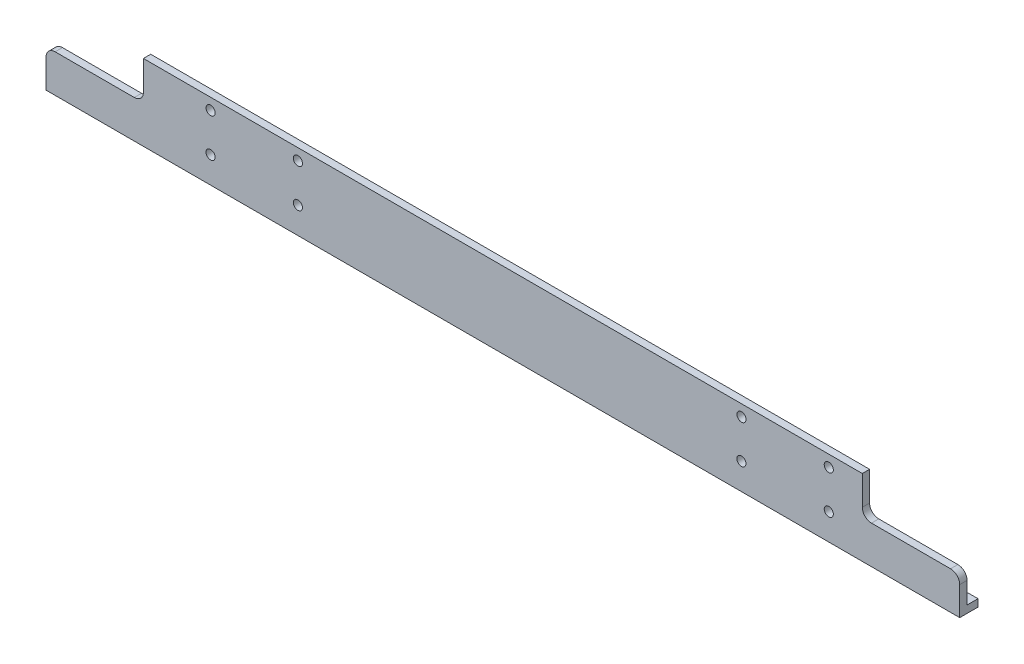
ISO-10303-21;
HEADER;
FILE_DESCRIPTION(('STEP AP214'),'2;1');
FILE_NAME('part.step','',(''),(''),'','','');
FILE_SCHEMA(('AUTOMOTIVE_DESIGN { 1 0 10303 214 1 1 1 1 }'));
ENDSEC;
DATA;
#1=APPLICATION_CONTEXT('core data for automotive mechanical design processes');
#2=APPLICATION_PROTOCOL_DEFINITION('international standard','automotive_design',2000,#1);
#3=PRODUCT_CONTEXT('',#1,'mechanical');
#4=PRODUCT('Part','Part','',(#3));
#5=PRODUCT_RELATED_PRODUCT_CATEGORY('part','',(#4));
#6=PRODUCT_DEFINITION_FORMATION('','',#4);
#7=PRODUCT_DEFINITION_CONTEXT('part definition',#1,'design');
#8=PRODUCT_DEFINITION('design','',#6,#7);
#9=PRODUCT_DEFINITION_SHAPE('','',#8);
#10=(LENGTH_UNIT() NAMED_UNIT(*) SI_UNIT(.MILLI.,.METRE.));
#11=(NAMED_UNIT(*) PLANE_ANGLE_UNIT() SI_UNIT($,.RADIAN.));
#12=(NAMED_UNIT(*) SI_UNIT($,.STERADIAN.) SOLID_ANGLE_UNIT());
#13=UNCERTAINTY_MEASURE_WITH_UNIT(LENGTH_MEASURE(1.E-05),#10,'distance_accuracy_value','');
#14=(GEOMETRIC_REPRESENTATION_CONTEXT(3) GLOBAL_UNCERTAINTY_ASSIGNED_CONTEXT((#13)) GLOBAL_UNIT_ASSIGNED_CONTEXT((#10,
#11,#12)) REPRESENTATION_CONTEXT('',''));
#15=CARTESIAN_POINT('',(0.,0.,0.));
#16=DIRECTION('',(0.,0.,1.));
#17=DIRECTION('',(1.,0.,0.));
#18=AXIS2_PLACEMENT_3D('',#15,#16,#17);
#19=CARTESIAN_POINT('',(-190.5,0.,0.));
#20=DIRECTION('',(-1.,0.,0.));
#21=DIRECTION('',(0.,0.,1.));
#22=AXIS2_PLACEMENT_3D('',#19,#20,#21);
#23=PLANE('',#22);
#24=DIRECTION('',(0.,-1.,0.));
#25=VECTOR('',#24,1.);
#26=CARTESIAN_POINT('',(-190.5,7.62,-7.62));
#27=LINE('',#26,#25);
#28=CARTESIAN_POINT('',(-190.5,3.048,-7.62));
#29=VERTEX_POINT('',#28);
#30=CARTESIAN_POINT('',(-190.5,0.,-7.62));
#31=VERTEX_POINT('',#30);
#32=EDGE_CURVE('E62',#29,#31,#27,.T.);
#33=ORIENTED_EDGE('',*,*,#32,.T.);
#34=DIRECTION('',(0.,0.,-1.));
#35=VECTOR('',#34,1.);
#36=CARTESIAN_POINT('',(-190.5,0.,0.));
#37=LINE('',#36,#35);
#38=CARTESIAN_POINT('',(-190.5,0.,0.));
#39=VERTEX_POINT('',#38);
#40=EDGE_CURVE('E175',#39,#31,#37,.T.);
#41=ORIENTED_EDGE('',*,*,#40,.F.);
#42=DIRECTION('',(0.,-1.,0.));
#43=VECTOR('',#42,1.);
#44=CARTESIAN_POINT('',(-190.5,0.,0.));
#45=LINE('',#44,#43);
#46=CARTESIAN_POINT('',(-190.5,11.938,0.));
#47=VERTEX_POINT('',#46);
#48=EDGE_CURVE('E173',#47,#39,#45,.T.);
#49=ORIENTED_EDGE('',*,*,#48,.F.);
#50=DIRECTION('',(0.,0.,1.));
#51=VECTOR('',#50,1.);
#52=CARTESIAN_POINT('',(-190.5,11.938,-31.75));
#53=LINE('',#52,#51);
#54=CARTESIAN_POINT('',(-190.5,11.938,-3.048));
#55=VERTEX_POINT('',#54);
#56=EDGE_CURVE('E213',#47,#55,#53,.F.);
#57=ORIENTED_EDGE('',*,*,#56,.T.);
#58=DIRECTION('',(0.,1.,0.));
#59=VECTOR('',#58,1.);
#60=CARTESIAN_POINT('',(-190.5,3.048,-3.048));
#61=LINE('',#60,#59);
#62=CARTESIAN_POINT('',(-190.5,3.048,-3.048));
#63=VERTEX_POINT('',#62);
#64=EDGE_CURVE('E181',#63,#55,#61,.T.);
#65=ORIENTED_EDGE('',*,*,#64,.F.);
#66=DIRECTION('',(0.,0.,1.));
#67=VECTOR('',#66,1.);
#68=CARTESIAN_POINT('',(-190.5,3.048,-3.048));
#69=LINE('',#68,#67);
#70=EDGE_CURVE('E179',#29,#63,#69,.T.);
#71=ORIENTED_EDGE('',*,*,#70,.F.);
#72=EDGE_LOOP('',(#33,#41,#49,#57,#65,#71));
#73=FACE_BOUND('',#72,.T.);
#74=ADVANCED_FACE('F47',(#73),#23,.T.);
#75=CARTESIAN_POINT('',(190.5,0.,0.));
#76=DIRECTION('',(-1.,0.,0.));
#77=DIRECTION('',(0.,0.,1.));
#78=AXIS2_PLACEMENT_3D('',#75,#76,#77);
#79=PLANE('',#78);
#80=DIRECTION('',(0.,0.,-1.));
#81=VECTOR('',#80,1.);
#82=CARTESIAN_POINT('',(190.5,0.,0.));
#83=LINE('',#82,#81);
#84=CARTESIAN_POINT('',(190.5,0.,0.));
#85=VERTEX_POINT('',#84);
#86=CARTESIAN_POINT('',(190.5,0.,-7.62));
#87=VERTEX_POINT('',#86);
#88=EDGE_CURVE('E159',#85,#87,#83,.T.);
#89=ORIENTED_EDGE('',*,*,#88,.T.);
#90=DIRECTION('',(0.,-1.,0.));
#91=VECTOR('',#90,1.);
#92=CARTESIAN_POINT('',(190.5,7.62,-7.62));
#93=LINE('',#92,#91);
#94=CARTESIAN_POINT('',(190.5,3.048,-7.62));
#95=VERTEX_POINT('',#94);
#96=EDGE_CURVE('E147',#95,#87,#93,.T.);
#97=ORIENTED_EDGE('',*,*,#96,.F.);
#98=DIRECTION('',(0.,0.,1.));
#99=VECTOR('',#98,1.);
#100=CARTESIAN_POINT('',(190.5,3.048,-3.048));
#101=LINE('',#100,#99);
#102=CARTESIAN_POINT('',(190.5,3.048,-3.048));
#103=VERTEX_POINT('',#102);
#104=EDGE_CURVE('E156',#95,#103,#101,.T.);
#105=ORIENTED_EDGE('',*,*,#104,.T.);
#106=DIRECTION('',(0.,1.,0.));
#107=VECTOR('',#106,1.);
#108=CARTESIAN_POINT('',(190.5,3.048,-3.048));
#109=LINE('',#108,#107);
#110=CARTESIAN_POINT('',(190.5,11.938,-3.048));
#111=VERTEX_POINT('',#110);
#112=EDGE_CURVE('E165',#103,#111,#109,.T.);
#113=ORIENTED_EDGE('',*,*,#112,.T.);
#114=DIRECTION('',(0.,0.,1.));
#115=VECTOR('',#114,1.);
#116=CARTESIAN_POINT('',(190.5,11.938,-31.75));
#117=LINE('',#116,#115);
#118=CARTESIAN_POINT('',(190.5,11.938,0.));
#119=VERTEX_POINT('',#118);
#120=EDGE_CURVE('E193',#119,#111,#117,.F.);
#121=ORIENTED_EDGE('',*,*,#120,.F.);
#122=DIRECTION('',(0.,-1.,0.));
#123=VECTOR('',#122,1.);
#124=CARTESIAN_POINT('',(190.5,0.,0.));
#125=LINE('',#124,#123);
#126=EDGE_CURVE('E169',#119,#85,#125,.T.);
#127=ORIENTED_EDGE('',*,*,#126,.T.);
#128=EDGE_LOOP('',(#89,#97,#105,#113,#121,#127));
#129=FACE_BOUND('',#128,.T.);
#130=ADVANCED_FACE('F154',(#129),#79,.F.);
#131=CARTESIAN_POINT('',(190.5,0.,0.));
#132=DIRECTION('',(0.,0.,-1.));
#133=DIRECTION('',(-1.,0.,0.));
#134=AXIS2_PLACEMENT_3D('',#131,#132,#133);
#135=PLANE('',#134);
#136=CARTESIAN_POINT('',(135.900000000001,27.,0.));
#137=DIRECTION('',(0.,0.,1.));
#138=DIRECTION('',(1.,0.,0.));
#139=AXIS2_PLACEMENT_3D('',#136,#137,#138);
#140=CIRCLE('',#139,1.89864999999997);
#141=CARTESIAN_POINT('',(137.798650000001,27.,0.));
#142=VERTEX_POINT('',#141);
#143=EDGE_CURVE('E272',#142,#142,#140,.T.);
#144=ORIENTED_EDGE('',*,*,#143,.F.);
#145=EDGE_LOOP('',(#144));
#146=FACE_BOUND('',#145,.T.);
#147=CARTESIAN_POINT('',(135.900000000001,11.,0.));
#148=DIRECTION('',(0.,0.,1.));
#149=DIRECTION('',(1.,0.,0.));
#150=AXIS2_PLACEMENT_3D('',#147,#148,#149);
#151=CIRCLE('',#150,1.89864999999997);
#152=CARTESIAN_POINT('',(137.798650000001,11.,0.));
#153=VERTEX_POINT('',#152);
#154=EDGE_CURVE('E202',#153,#153,#151,.T.);
#155=ORIENTED_EDGE('',*,*,#154,.F.);
#156=EDGE_LOOP('',(#155));
#157=FACE_BOUND('',#156,.T.);
#158=CARTESIAN_POINT('',(99.5,27.,0.));
#159=DIRECTION('',(0.,0.,1.));
#160=DIRECTION('',(1.,0.,0.));
#161=AXIS2_PLACEMENT_3D('',#158,#159,#160);
#162=CIRCLE('',#161,1.89864999999999);
#163=CARTESIAN_POINT('',(101.39865,27.,0.));
#164=VERTEX_POINT('',#163);
#165=EDGE_CURVE('E198',#164,#164,#162,.T.);
#166=ORIENTED_EDGE('',*,*,#165,.F.);
#167=EDGE_LOOP('',(#166));
#168=FACE_BOUND('',#167,.T.);
#169=CARTESIAN_POINT('',(99.468,11.0000000000001,0.));
#170=DIRECTION('',(0.,0.,1.));
#171=DIRECTION('',(1.,0.,0.));
#172=AXIS2_PLACEMENT_3D('',#169,#170,#171);
#173=CIRCLE('',#172,1.89864999999999);
#174=CARTESIAN_POINT('',(101.36665,11.0000000000001,0.));
#175=VERTEX_POINT('',#174);
#176=EDGE_CURVE('E197',#175,#175,#173,.T.);
#177=ORIENTED_EDGE('',*,*,#176,.F.);
#178=EDGE_LOOP('',(#177));
#179=FACE_BOUND('',#178,.T.);
#180=CARTESIAN_POINT('',(-121.867999999999,27.,0.));
#181=DIRECTION('',(0.,0.,1.));
#182=DIRECTION('',(1.,0.,0.));
#183=AXIS2_PLACEMENT_3D('',#180,#181,#182);
#184=CIRCLE('',#183,1.89864999999999);
#185=CARTESIAN_POINT('',(-119.969349999999,27.,0.));
#186=VERTEX_POINT('',#185);
#187=EDGE_CURVE('E287',#186,#186,#184,.T.);
#188=ORIENTED_EDGE('',*,*,#187,.F.);
#189=EDGE_LOOP('',(#188));
#190=FACE_BOUND('',#189,.T.);
#191=CARTESIAN_POINT('',(-121.867999999999,11.,0.));
#192=DIRECTION('',(0.,0.,1.));
#193=DIRECTION('',(1.,0.,0.));
#194=AXIS2_PLACEMENT_3D('',#191,#192,#193);
#195=CIRCLE('',#194,1.89864999999999);
#196=CARTESIAN_POINT('',(-119.969349999999,11.,0.));
#197=VERTEX_POINT('',#196);
#198=EDGE_CURVE('E293',#197,#197,#195,.T.);
#199=ORIENTED_EDGE('',*,*,#198,.F.);
#200=EDGE_LOOP('',(#199));
#201=FACE_BOUND('',#200,.T.);
#202=CARTESIAN_POINT('',(-85.468,11.,0.));
#203=DIRECTION('',(0.,0.,1.));
#204=DIRECTION('',(1.,0.,0.));
#205=AXIS2_PLACEMENT_3D('',#202,#203,#204);
#206=CIRCLE('',#205,1.89864999999999);
#207=CARTESIAN_POINT('',(-83.56935,11.,0.));
#208=VERTEX_POINT('',#207);
#209=EDGE_CURVE('E299',#208,#208,#206,.T.);
#210=ORIENTED_EDGE('',*,*,#209,.F.);
#211=EDGE_LOOP('',(#210));
#212=FACE_BOUND('',#211,.T.);
#213=CARTESIAN_POINT('',(-85.468,27.,0.));
#214=DIRECTION('',(0.,0.,1.));
#215=DIRECTION('',(1.,0.,0.));
#216=AXIS2_PLACEMENT_3D('',#213,#214,#215);
#217=CIRCLE('',#216,1.89864999999999);
#218=CARTESIAN_POINT('',(-83.56935,27.,0.));
#219=VERTEX_POINT('',#218);
#220=EDGE_CURVE('E305',#219,#219,#217,.T.);
#221=ORIENTED_EDGE('',*,*,#220,.F.);
#222=EDGE_LOOP('',(#221));
#223=FACE_BOUND('',#222,.T.);
#224=DIRECTION('',(1.,0.,0.));
#225=VECTOR('',#224,1.);
#226=CARTESIAN_POINT('',(-153.686999999998,15.748,0.));
#227=LINE('',#226,#225);
#228=CARTESIAN_POINT('',(-186.69,15.748,0.));
#229=VERTEX_POINT('',#228);
#230=CARTESIAN_POINT('',(-153.686999999998,15.748,0.));
#231=VERTEX_POINT('',#230);
#232=EDGE_CURVE('E238',#229,#231,#227,.T.);
#233=ORIENTED_EDGE('',*,*,#232,.F.);
#234=CARTESIAN_POINT('',(-186.69,11.938,0.));
#235=DIRECTION('',(0.,0.,-1.));
#236=DIRECTION('',(-1.,0.,0.));
#237=AXIS2_PLACEMENT_3D('',#234,#235,#236);
#238=CIRCLE('',#237,3.81);
#239=EDGE_CURVE('E321',#47,#229,#238,.T.);
#240=ORIENTED_EDGE('',*,*,#239,.F.);
#241=ORIENTED_EDGE('',*,*,#48,.T.);
#242=DIRECTION('',(-1.,0.,0.));
#243=VECTOR('',#242,1.);
#244=CARTESIAN_POINT('',(190.5,0.,0.));
#245=LINE('',#244,#243);
#246=EDGE_CURVE('E190',#85,#39,#245,.T.);
#247=ORIENTED_EDGE('',*,*,#246,.F.);
#248=ORIENTED_EDGE('',*,*,#126,.F.);
#249=CARTESIAN_POINT('',(186.69,11.938,0.));
#250=DIRECTION('',(0.,0.,-1.));
#251=DIRECTION('',(1.,0.,0.));
#252=AXIS2_PLACEMENT_3D('',#249,#250,#251);
#253=CIRCLE('',#252,3.81);
#254=CARTESIAN_POINT('',(186.69,15.748,0.));
#255=VERTEX_POINT('',#254);
#256=EDGE_CURVE('E249',#255,#119,#253,.T.);
#257=ORIENTED_EDGE('',*,*,#256,.F.);
#258=DIRECTION('',(1.,0.,0.));
#259=VECTOR('',#258,1.);
#260=CARTESIAN_POINT('',(153.686999999998,15.748,0.));
#261=LINE('',#260,#259);
#262=CARTESIAN_POINT('',(153.686999999998,15.748,0.));
#263=VERTEX_POINT('',#262);
#264=EDGE_CURVE('E257',#263,#255,#261,.T.);
#265=ORIENTED_EDGE('',*,*,#264,.F.);
#266=CARTESIAN_POINT('',(153.686999999998,19.558,0.));
#267=DIRECTION('',(0.,0.,1.));
#268=DIRECTION('',(1.,0.,0.));
#269=AXIS2_PLACEMENT_3D('',#266,#267,#268);
#270=CIRCLE('',#269,3.81);
#271=CARTESIAN_POINT('',(149.876999999998,19.558,0.));
#272=VERTEX_POINT('',#271);
#273=EDGE_CURVE('E254',#272,#263,#270,.T.);
#274=ORIENTED_EDGE('',*,*,#273,.F.);
#275=DIRECTION('',(0.,-1.,0.));
#276=VECTOR('',#275,1.);
#277=CARTESIAN_POINT('',(149.876999999998,41.148,0.));
#278=LINE('',#277,#276);
#279=CARTESIAN_POINT('',(149.876999999998,31.75,0.));
#280=VERTEX_POINT('',#279);
#281=EDGE_CURVE('E251',#280,#272,#278,.T.);
#282=ORIENTED_EDGE('',*,*,#281,.F.);
#283=DIRECTION('',(-1.,0.,0.));
#284=VECTOR('',#283,1.);
#285=CARTESIAN_POINT('',(190.5,31.75,0.));
#286=LINE('',#285,#284);
#287=CARTESIAN_POINT('',(-149.876999999998,31.75,0.));
#288=VERTEX_POINT('',#287);
#289=EDGE_CURVE('E167',#280,#288,#286,.T.);
#290=ORIENTED_EDGE('',*,*,#289,.T.);
#291=DIRECTION('',(0.,1.,0.));
#292=VECTOR('',#291,1.);
#293=CARTESIAN_POINT('',(-149.876999999998,41.148,0.));
#294=LINE('',#293,#292);
#295=CARTESIAN_POINT('',(-149.876999999998,19.558,0.));
#296=VERTEX_POINT('',#295);
#297=EDGE_CURVE('E243',#296,#288,#294,.T.);
#298=ORIENTED_EDGE('',*,*,#297,.F.);
#299=CARTESIAN_POINT('',(-153.686999999998,19.558,0.));
#300=DIRECTION('',(0.,0.,1.));
#301=DIRECTION('',(-1.,0.,0.));
#302=AXIS2_PLACEMENT_3D('',#299,#300,#301);
#303=CIRCLE('',#302,3.81);
#304=EDGE_CURVE('E329',#231,#296,#303,.T.);
#305=ORIENTED_EDGE('',*,*,#304,.F.);
#306=EDGE_LOOP('',(#233,#240,#241,#247,#248,#257,#265,#274,#282,#290,#298,#305));
#307=FACE_BOUND('',#306,.T.);
#308=ADVANCED_FACE('F49',(#146,#157,#168,#179,#190,#201,#212,#223,#307),#135,.F.);
#309=CARTESIAN_POINT('',(190.5,0.,0.));
#310=DIRECTION('',(0.,1.,0.));
#311=DIRECTION('',(0.,0.,1.));
#312=AXIS2_PLACEMENT_3D('',#309,#310,#311);
#313=PLANE('',#312);
#314=ORIENTED_EDGE('',*,*,#40,.T.);
#315=DIRECTION('',(1.,0.,0.));
#316=VECTOR('',#315,1.);
#317=CARTESIAN_POINT('',(190.5,0.,-7.62));
#318=LINE('',#317,#316);
#319=EDGE_CURVE('E316',#31,#87,#318,.T.);
#320=ORIENTED_EDGE('',*,*,#319,.T.);
#321=ORIENTED_EDGE('',*,*,#88,.F.);
#322=ORIENTED_EDGE('',*,*,#246,.T.);
#323=EDGE_LOOP('',(#314,#320,#321,#322));
#324=FACE_BOUND('',#323,.T.);
#325=ADVANCED_FACE('F315',(#324),#313,.F.);
#326=CARTESIAN_POINT('',(190.5,3.048,-3.048));
#327=DIRECTION('',(0.,-1.,0.));
#328=DIRECTION('',(0.,0.,-1.));
#329=AXIS2_PLACEMENT_3D('',#326,#327,#328);
#330=PLANE('',#329);
#331=ORIENTED_EDGE('',*,*,#104,.F.);
#332=DIRECTION('',(-1.,0.,0.));
#333=VECTOR('',#332,1.);
#334=CARTESIAN_POINT('',(190.5,3.048,-7.62));
#335=LINE('',#334,#333);
#336=EDGE_CURVE('E13',#95,#29,#335,.T.);
#337=ORIENTED_EDGE('',*,*,#336,.T.);
#338=ORIENTED_EDGE('',*,*,#70,.T.);
#339=DIRECTION('',(-1.,0.,0.));
#340=VECTOR('',#339,1.);
#341=CARTESIAN_POINT('',(190.5,3.048,-3.048));
#342=LINE('',#341,#340);
#343=EDGE_CURVE('E163',#103,#63,#342,.T.);
#344=ORIENTED_EDGE('',*,*,#343,.F.);
#345=EDGE_LOOP('',(#331,#337,#338,#344));
#346=FACE_BOUND('',#345,.T.);
#347=ADVANCED_FACE('F161',(#346),#330,.F.);
#348=CARTESIAN_POINT('',(190.5,3.048,-3.048));
#349=DIRECTION('',(0.,0.,1.));
#350=DIRECTION('',(1.,0.,0.));
#351=AXIS2_PLACEMENT_3D('',#348,#349,#350);
#352=PLANE('',#351);
#353=ORIENTED_EDGE('',*,*,#64,.T.);
#354=CARTESIAN_POINT('',(-186.69,11.938,-3.048));
#355=DIRECTION('',(0.,0.,1.));
#356=DIRECTION('',(1.,0.,0.));
#357=AXIS2_PLACEMENT_3D('',#354,#355,#356);
#358=CIRCLE('',#357,3.81);
#359=CARTESIAN_POINT('',(-186.69,15.748,-3.048));
#360=VERTEX_POINT('',#359);
#361=EDGE_CURVE('E69',#55,#360,#358,.F.);
#362=ORIENTED_EDGE('',*,*,#361,.T.);
#363=DIRECTION('',(1.,0.,0.));
#364=VECTOR('',#363,1.);
#365=CARTESIAN_POINT('',(190.5,15.7479999999999,-3.048));
#366=LINE('',#365,#364);
#367=CARTESIAN_POINT('',(-153.686999999998,15.748,-3.048));
#368=VERTEX_POINT('',#367);
#369=EDGE_CURVE('E218',#360,#368,#366,.T.);
#370=ORIENTED_EDGE('',*,*,#369,.T.);
#371=CARTESIAN_POINT('',(-153.686999999998,19.558,-3.048));
#372=DIRECTION('',(0.,0.,1.));
#373=DIRECTION('',(1.,0.,0.));
#374=AXIS2_PLACEMENT_3D('',#371,#372,#373);
#375=CIRCLE('',#374,3.81);
#376=CARTESIAN_POINT('',(-149.876999999998,19.558,-3.048));
#377=VERTEX_POINT('',#376);
#378=EDGE_CURVE('E55',#368,#377,#375,.T.);
#379=ORIENTED_EDGE('',*,*,#378,.T.);
#380=DIRECTION('',(0.,1.,0.));
#381=VECTOR('',#380,1.);
#382=CARTESIAN_POINT('',(-149.876999999998,3.048,-3.048));
#383=LINE('',#382,#381);
#384=CARTESIAN_POINT('',(-149.876999999998,31.75,-3.048));
#385=VERTEX_POINT('',#384);
#386=EDGE_CURVE('E226',#377,#385,#383,.T.);
#387=ORIENTED_EDGE('',*,*,#386,.T.);
#388=DIRECTION('',(-1.,0.,0.));
#389=VECTOR('',#388,1.);
#390=CARTESIAN_POINT('',(190.5,31.75,-3.048));
#391=LINE('',#390,#389);
#392=CARTESIAN_POINT('',(149.876999999998,31.75,-3.048));
#393=VERTEX_POINT('',#392);
#394=EDGE_CURVE('E186',#393,#385,#391,.T.);
#395=ORIENTED_EDGE('',*,*,#394,.F.);
#396=DIRECTION('',(0.,-1.,0.));
#397=VECTOR('',#396,1.);
#398=CARTESIAN_POINT('',(149.876999999998,3.048,-3.048));
#399=LINE('',#398,#397);
#400=CARTESIAN_POINT('',(149.876999999998,19.558,-3.048));
#401=VERTEX_POINT('',#400);
#402=EDGE_CURVE('E269',#393,#401,#399,.T.);
#403=ORIENTED_EDGE('',*,*,#402,.T.);
#404=CARTESIAN_POINT('',(153.686999999998,19.558,-3.048));
#405=DIRECTION('',(0.,0.,1.));
#406=DIRECTION('',(1.,0.,0.));
#407=AXIS2_PLACEMENT_3D('',#404,#405,#406);
#408=CIRCLE('',#407,3.81);
#409=CARTESIAN_POINT('',(153.686999999998,15.748,-3.048));
#410=VERTEX_POINT('',#409);
#411=EDGE_CURVE('E207',#401,#410,#408,.T.);
#412=ORIENTED_EDGE('',*,*,#411,.T.);
#413=DIRECTION('',(1.,0.,0.));
#414=VECTOR('',#413,1.);
#415=CARTESIAN_POINT('',(190.5,15.748,-3.048));
#416=LINE('',#415,#414);
#417=CARTESIAN_POINT('',(186.69,15.748,-3.048));
#418=VERTEX_POINT('',#417);
#419=EDGE_CURVE('E210',#410,#418,#416,.T.);
#420=ORIENTED_EDGE('',*,*,#419,.T.);
#421=CARTESIAN_POINT('',(186.69,11.938,-3.048));
#422=DIRECTION('',(0.,0.,1.));
#423=DIRECTION('',(1.,0.,0.));
#424=AXIS2_PLACEMENT_3D('',#421,#422,#423);
#425=CIRCLE('',#424,3.81);
#426=EDGE_CURVE('E263',#418,#111,#425,.F.);
#427=ORIENTED_EDGE('',*,*,#426,.T.);
#428=ORIENTED_EDGE('',*,*,#112,.F.);
#429=ORIENTED_EDGE('',*,*,#343,.T.);
#430=EDGE_LOOP('',(#353,#362,#370,#379,#387,#395,#403,#412,#420,#427,#428,#429));
#431=FACE_BOUND('',#430,.T.);
#432=CARTESIAN_POINT('',(135.900000000001,27.,-3.048));
#433=DIRECTION('',(0.,0.,1.));
#434=DIRECTION('',(1.,0.,0.));
#435=AXIS2_PLACEMENT_3D('',#432,#433,#434);
#436=CIRCLE('',#435,1.89864999999999);
#437=CARTESIAN_POINT('',(137.798650000001,27.,-3.048));
#438=VERTEX_POINT('',#437);
#439=EDGE_CURVE('E275',#438,#438,#436,.T.);
#440=ORIENTED_EDGE('',*,*,#439,.T.);
#441=EDGE_LOOP('',(#440));
#442=FACE_BOUND('',#441,.T.);
#443=CARTESIAN_POINT('',(135.900000000001,11.,-3.048));
#444=DIRECTION('',(0.,0.,1.));
#445=DIRECTION('',(1.,0.,0.));
#446=AXIS2_PLACEMENT_3D('',#443,#444,#445);
#447=CIRCLE('',#446,1.89864999999999);
#448=CARTESIAN_POINT('',(137.798650000001,11.,-3.048));
#449=VERTEX_POINT('',#448);
#450=EDGE_CURVE('E199',#449,#449,#447,.T.);
#451=ORIENTED_EDGE('',*,*,#450,.T.);
#452=EDGE_LOOP('',(#451));
#453=FACE_BOUND('',#452,.T.);
#454=CARTESIAN_POINT('',(99.5,27.,-3.048));
#455=DIRECTION('',(0.,0.,1.));
#456=DIRECTION('',(1.,0.,0.));
#457=AXIS2_PLACEMENT_3D('',#454,#455,#456);
#458=CIRCLE('',#457,1.89864999999999);
#459=CARTESIAN_POINT('',(101.39865,27.,-3.048));
#460=VERTEX_POINT('',#459);
#461=EDGE_CURVE('E194',#460,#460,#458,.T.);
#462=ORIENTED_EDGE('',*,*,#461,.T.);
#463=EDGE_LOOP('',(#462));
#464=FACE_BOUND('',#463,.T.);
#465=CARTESIAN_POINT('',(99.468,11.0000000000001,-3.048));
#466=DIRECTION('',(0.,0.,1.));
#467=DIRECTION('',(1.,0.,0.));
#468=AXIS2_PLACEMENT_3D('',#465,#466,#467);
#469=CIRCLE('',#468,1.89864999999999);
#470=CARTESIAN_POINT('',(101.36665,11.0000000000001,-3.048));
#471=VERTEX_POINT('',#470);
#472=EDGE_CURVE('E284',#471,#471,#469,.T.);
#473=ORIENTED_EDGE('',*,*,#472,.T.);
#474=EDGE_LOOP('',(#473));
#475=FACE_BOUND('',#474,.T.);
#476=CARTESIAN_POINT('',(-121.867999999999,27.,-3.048));
#477=DIRECTION('',(0.,0.,1.));
#478=DIRECTION('',(1.,0.,0.));
#479=AXIS2_PLACEMENT_3D('',#476,#477,#478);
#480=CIRCLE('',#479,1.89864999999999);
#481=CARTESIAN_POINT('',(-119.969349999999,27.,-3.048));
#482=VERTEX_POINT('',#481);
#483=EDGE_CURVE('E290',#482,#482,#480,.T.);
#484=ORIENTED_EDGE('',*,*,#483,.T.);
#485=EDGE_LOOP('',(#484));
#486=FACE_BOUND('',#485,.T.);
#487=CARTESIAN_POINT('',(-121.867999999999,11.,-3.048));
#488=DIRECTION('',(0.,0.,1.));
#489=DIRECTION('',(1.,0.,0.));
#490=AXIS2_PLACEMENT_3D('',#487,#488,#489);
#491=CIRCLE('',#490,1.89864999999999);
#492=CARTESIAN_POINT('',(-119.969349999999,11.,-3.048));
#493=VERTEX_POINT('',#492);
#494=EDGE_CURVE('E296',#493,#493,#491,.T.);
#495=ORIENTED_EDGE('',*,*,#494,.T.);
#496=EDGE_LOOP('',(#495));
#497=FACE_BOUND('',#496,.T.);
#498=CARTESIAN_POINT('',(-85.468,11.,-3.048));
#499=DIRECTION('',(0.,0.,1.));
#500=DIRECTION('',(1.,0.,0.));
#501=AXIS2_PLACEMENT_3D('',#498,#499,#500);
#502=CIRCLE('',#501,1.89864999999999);
#503=CARTESIAN_POINT('',(-83.56935,11.,-3.048));
#504=VERTEX_POINT('',#503);
#505=EDGE_CURVE('E302',#504,#504,#502,.T.);
#506=ORIENTED_EDGE('',*,*,#505,.T.);
#507=EDGE_LOOP('',(#506));
#508=FACE_BOUND('',#507,.T.);
#509=CARTESIAN_POINT('',(-85.468,27.,-3.048));
#510=DIRECTION('',(0.,0.,1.));
#511=DIRECTION('',(1.,0.,0.));
#512=AXIS2_PLACEMENT_3D('',#509,#510,#511);
#513=CIRCLE('',#512,1.89864999999999);
#514=CARTESIAN_POINT('',(-83.56935,27.,-3.048));
#515=VERTEX_POINT('',#514);
#516=EDGE_CURVE('E176',#515,#515,#513,.T.);
#517=ORIENTED_EDGE('',*,*,#516,.T.);
#518=EDGE_LOOP('',(#517));
#519=FACE_BOUND('',#518,.T.);
#520=ADVANCED_FACE('F223',(#431,#442,#453,#464,#475,#486,#497,#508,#519),#352,.F.);
#521=CARTESIAN_POINT('',(190.5,31.75,0.));
#522=DIRECTION('',(0.,-1.,0.));
#523=DIRECTION('',(0.,0.,-1.));
#524=AXIS2_PLACEMENT_3D('',#521,#522,#523);
#525=PLANE('',#524);
#526=ORIENTED_EDGE('',*,*,#394,.T.);
#527=DIRECTION('',(0.,0.,1.));
#528=VECTOR('',#527,1.);
#529=CARTESIAN_POINT('',(-149.876999999998,31.75,0.));
#530=LINE('',#529,#528);
#531=EDGE_CURVE('E215',#385,#288,#530,.T.);
#532=ORIENTED_EDGE('',*,*,#531,.T.);
#533=ORIENTED_EDGE('',*,*,#289,.F.);
#534=DIRECTION('',(0.,0.,-1.));
#535=VECTOR('',#534,1.);
#536=CARTESIAN_POINT('',(149.876999999998,31.75,0.));
#537=LINE('',#536,#535);
#538=EDGE_CURVE('E204',#280,#393,#537,.T.);
#539=ORIENTED_EDGE('',*,*,#538,.T.);
#540=EDGE_LOOP('',(#526,#532,#533,#539));
#541=FACE_BOUND('',#540,.T.);
#542=ADVANCED_FACE('F335',(#541),#525,.F.);
#543=CARTESIAN_POINT('',(-85.468,27.,0.));
#544=DIRECTION('',(0.,0.,1.));
#545=DIRECTION('',(1.,0.,0.));
#546=AXIS2_PLACEMENT_3D('',#543,#544,#545);
#547=CYLINDRICAL_SURFACE('',#546,1.89864999999999);
#548=ORIENTED_EDGE('',*,*,#220,.T.);
#549=EDGE_LOOP('',(#548));
#550=FACE_BOUND('',#549,.T.);
#551=ORIENTED_EDGE('',*,*,#516,.F.);
#552=EDGE_LOOP('',(#551));
#553=FACE_BOUND('',#552,.T.);
#554=ADVANCED_FACE('F371',(#550,#553),#547,.F.);
#555=CARTESIAN_POINT('',(-85.468,11.,0.));
#556=DIRECTION('',(0.,0.,1.));
#557=DIRECTION('',(1.,0.,0.));
#558=AXIS2_PLACEMENT_3D('',#555,#556,#557);
#559=CYLINDRICAL_SURFACE('',#558,1.89864999999999);
#560=ORIENTED_EDGE('',*,*,#209,.T.);
#561=EDGE_LOOP('',(#560));
#562=FACE_BOUND('',#561,.T.);
#563=ORIENTED_EDGE('',*,*,#505,.F.);
#564=EDGE_LOOP('',(#563));
#565=FACE_BOUND('',#564,.T.);
#566=ADVANCED_FACE('F400',(#562,#565),#559,.F.);
#567=CARTESIAN_POINT('',(-121.867999999999,11.,0.));
#568=DIRECTION('',(0.,0.,1.));
#569=DIRECTION('',(1.,0.,0.));
#570=AXIS2_PLACEMENT_3D('',#567,#568,#569);
#571=CYLINDRICAL_SURFACE('',#570,1.89864999999999);
#572=ORIENTED_EDGE('',*,*,#198,.T.);
#573=EDGE_LOOP('',(#572));
#574=FACE_BOUND('',#573,.T.);
#575=ORIENTED_EDGE('',*,*,#494,.F.);
#576=EDGE_LOOP('',(#575));
#577=FACE_BOUND('',#576,.T.);
#578=ADVANCED_FACE('F406',(#574,#577),#571,.F.);
#579=CARTESIAN_POINT('',(-121.867999999999,27.,0.));
#580=DIRECTION('',(0.,0.,1.));
#581=DIRECTION('',(1.,0.,0.));
#582=AXIS2_PLACEMENT_3D('',#579,#580,#581);
#583=CYLINDRICAL_SURFACE('',#582,1.89864999999999);
#584=ORIENTED_EDGE('',*,*,#187,.T.);
#585=EDGE_LOOP('',(#584));
#586=FACE_BOUND('',#585,.T.);
#587=ORIENTED_EDGE('',*,*,#483,.F.);
#588=EDGE_LOOP('',(#587));
#589=FACE_BOUND('',#588,.T.);
#590=ADVANCED_FACE('F412',(#586,#589),#583,.F.);
#591=CARTESIAN_POINT('',(99.468,11.0000000000001,0.));
#592=DIRECTION('',(0.,0.,1.));
#593=DIRECTION('',(1.,0.,0.));
#594=AXIS2_PLACEMENT_3D('',#591,#592,#593);
#595=CYLINDRICAL_SURFACE('',#594,1.89864999999999);
#596=ORIENTED_EDGE('',*,*,#176,.T.);
#597=EDGE_LOOP('',(#596));
#598=FACE_BOUND('',#597,.T.);
#599=ORIENTED_EDGE('',*,*,#472,.F.);
#600=EDGE_LOOP('',(#599));
#601=FACE_BOUND('',#600,.T.);
#602=ADVANCED_FACE('F416',(#598,#601),#595,.F.);
#603=CARTESIAN_POINT('',(99.5,27.,0.));
#604=DIRECTION('',(0.,0.,1.));
#605=DIRECTION('',(1.,0.,0.));
#606=AXIS2_PLACEMENT_3D('',#603,#604,#605);
#607=CYLINDRICAL_SURFACE('',#606,1.89864999999999);
#608=ORIENTED_EDGE('',*,*,#165,.T.);
#609=EDGE_LOOP('',(#608));
#610=FACE_BOUND('',#609,.T.);
#611=ORIENTED_EDGE('',*,*,#461,.F.);
#612=EDGE_LOOP('',(#611));
#613=FACE_BOUND('',#612,.T.);
#614=ADVANCED_FACE('F420',(#610,#613),#607,.F.);
#615=CARTESIAN_POINT('',(135.900000000001,11.,0.));
#616=DIRECTION('',(0.,0.,1.));
#617=DIRECTION('',(1.,0.,0.));
#618=AXIS2_PLACEMENT_3D('',#615,#616,#617);
#619=CYLINDRICAL_SURFACE('',#618,1.89864999999999);
#620=ORIENTED_EDGE('',*,*,#154,.T.);
#621=EDGE_LOOP('',(#620));
#622=FACE_BOUND('',#621,.T.);
#623=ORIENTED_EDGE('',*,*,#450,.F.);
#624=EDGE_LOOP('',(#623));
#625=FACE_BOUND('',#624,.T.);
#626=ADVANCED_FACE('F424',(#622,#625),#619,.F.);
#627=CARTESIAN_POINT('',(135.900000000001,27.,0.));
#628=DIRECTION('',(0.,0.,1.));
#629=DIRECTION('',(1.,0.,0.));
#630=AXIS2_PLACEMENT_3D('',#627,#628,#629);
#631=CYLINDRICAL_SURFACE('',#630,1.89864999999999);
#632=ORIENTED_EDGE('',*,*,#143,.T.);
#633=EDGE_LOOP('',(#632));
#634=FACE_BOUND('',#633,.T.);
#635=ORIENTED_EDGE('',*,*,#439,.F.);
#636=EDGE_LOOP('',(#635));
#637=FACE_BOUND('',#636,.T.);
#638=ADVANCED_FACE('F428',(#634,#637),#631,.F.);
#639=CARTESIAN_POINT('',(153.686999999998,15.748,-31.75));
#640=DIRECTION('',(0.,-1.,0.));
#641=DIRECTION('',(1.,0.,0.));
#642=AXIS2_PLACEMENT_3D('',#639,#640,#641);
#643=PLANE('',#642);
#644=DIRECTION('',(0.,0.,1.));
#645=VECTOR('',#644,1.);
#646=CARTESIAN_POINT('',(153.686999999998,15.748,-31.75));
#647=LINE('',#646,#645);
#648=EDGE_CURVE('E264',#410,#263,#647,.T.);
#649=ORIENTED_EDGE('',*,*,#648,.T.);
#650=ORIENTED_EDGE('',*,*,#264,.T.);
#651=DIRECTION('',(0.,0.,1.));
#652=VECTOR('',#651,1.);
#653=CARTESIAN_POINT('',(186.69,15.748,-31.75));
#654=LINE('',#653,#652);
#655=EDGE_CURVE('E261',#418,#255,#654,.T.);
#656=ORIENTED_EDGE('',*,*,#655,.F.);
#657=ORIENTED_EDGE('',*,*,#419,.F.);
#658=EDGE_LOOP('',(#649,#650,#656,#657));
#659=FACE_BOUND('',#658,.T.);
#660=ADVANCED_FACE('F346',(#659),#643,.F.);
#661=CARTESIAN_POINT('',(153.686999999998,19.558,-31.75));
#662=DIRECTION('',(0.,0.,1.));
#663=DIRECTION('',(1.,0.,0.));
#664=AXIS2_PLACEMENT_3D('',#661,#662,#663);
#665=CYLINDRICAL_SURFACE('',#664,3.81);
#666=DIRECTION('',(0.,0.,1.));
#667=VECTOR('',#666,1.);
#668=CARTESIAN_POINT('',(149.876999999998,19.558,-31.75));
#669=LINE('',#668,#667);
#670=EDGE_CURVE('E260',#401,#272,#669,.T.);
#671=ORIENTED_EDGE('',*,*,#670,.T.);
#672=ORIENTED_EDGE('',*,*,#273,.T.);
#673=ORIENTED_EDGE('',*,*,#648,.F.);
#674=ORIENTED_EDGE('',*,*,#411,.F.);
#675=EDGE_LOOP('',(#671,#672,#673,#674));
#676=FACE_BOUND('',#675,.T.);
#677=ADVANCED_FACE('F344',(#676),#665,.F.);
#678=CARTESIAN_POINT('',(149.876999999998,41.148,-31.75));
#679=DIRECTION('',(-1.,0.,0.));
#680=DIRECTION('',(0.,0.,1.));
#681=AXIS2_PLACEMENT_3D('',#678,#679,#680);
#682=PLANE('',#681);
#683=ORIENTED_EDGE('',*,*,#538,.F.);
#684=ORIENTED_EDGE('',*,*,#281,.T.);
#685=ORIENTED_EDGE('',*,*,#670,.F.);
#686=ORIENTED_EDGE('',*,*,#402,.F.);
#687=EDGE_LOOP('',(#683,#684,#685,#686));
#688=FACE_BOUND('',#687,.T.);
#689=ADVANCED_FACE('F341',(#688),#682,.F.);
#690=CARTESIAN_POINT('',(186.69,11.938,-31.75));
#691=DIRECTION('',(0.,0.,1.));
#692=DIRECTION('',(1.,0.,0.));
#693=AXIS2_PLACEMENT_3D('',#690,#691,#692);
#694=CYLINDRICAL_SURFACE('',#693,3.81);
#695=ORIENTED_EDGE('',*,*,#655,.T.);
#696=ORIENTED_EDGE('',*,*,#256,.T.);
#697=ORIENTED_EDGE('',*,*,#120,.T.);
#698=ORIENTED_EDGE('',*,*,#426,.F.);
#699=EDGE_LOOP('',(#695,#696,#697,#698));
#700=FACE_BOUND('',#699,.T.);
#701=ADVANCED_FACE('F349',(#700),#694,.T.);
#702=CARTESIAN_POINT('',(-153.686999999998,19.558,-31.75));
#703=DIRECTION('',(0.,0.,1.));
#704=DIRECTION('',(1.,0.,0.));
#705=AXIS2_PLACEMENT_3D('',#702,#703,#704);
#706=CYLINDRICAL_SURFACE('',#705,3.81);
#707=DIRECTION('',(0.,0.,1.));
#708=VECTOR('',#707,1.);
#709=CARTESIAN_POINT('',(-153.686999999998,15.748,-31.75));
#710=LINE('',#709,#708);
#711=EDGE_CURVE('E232',#368,#231,#710,.T.);
#712=ORIENTED_EDGE('',*,*,#711,.T.);
#713=ORIENTED_EDGE('',*,*,#304,.T.);
#714=DIRECTION('',(0.,0.,1.));
#715=VECTOR('',#714,1.);
#716=CARTESIAN_POINT('',(-149.876999999998,19.558,-31.75));
#717=LINE('',#716,#715);
#718=EDGE_CURVE('E234',#377,#296,#717,.T.);
#719=ORIENTED_EDGE('',*,*,#718,.F.);
#720=ORIENTED_EDGE('',*,*,#378,.F.);
#721=EDGE_LOOP('',(#712,#713,#719,#720));
#722=FACE_BOUND('',#721,.T.);
#723=ADVANCED_FACE('F230',(#722),#706,.F.);
#724=CARTESIAN_POINT('',(-153.686999999998,15.748,-31.75));
#725=DIRECTION('',(0.,-1.,0.));
#726=DIRECTION('',(1.,0.,0.));
#727=AXIS2_PLACEMENT_3D('',#724,#725,#726);
#728=PLANE('',#727);
#729=DIRECTION('',(0.,0.,1.));
#730=VECTOR('',#729,1.);
#731=CARTESIAN_POINT('',(-186.69,15.748,-31.75));
#732=LINE('',#731,#730);
#733=EDGE_CURVE('E240',#360,#229,#732,.T.);
#734=ORIENTED_EDGE('',*,*,#733,.T.);
#735=ORIENTED_EDGE('',*,*,#232,.T.);
#736=ORIENTED_EDGE('',*,*,#711,.F.);
#737=ORIENTED_EDGE('',*,*,#369,.F.);
#738=EDGE_LOOP('',(#734,#735,#736,#737));
#739=FACE_BOUND('',#738,.T.);
#740=ADVANCED_FACE('F236',(#739),#728,.F.);
#741=CARTESIAN_POINT('',(-149.876999999998,41.148,-31.75));
#742=DIRECTION('',(1.,0.,0.));
#743=DIRECTION('',(0.,0.,-1.));
#744=AXIS2_PLACEMENT_3D('',#741,#742,#743);
#745=PLANE('',#744);
#746=ORIENTED_EDGE('',*,*,#718,.T.);
#747=ORIENTED_EDGE('',*,*,#297,.T.);
#748=ORIENTED_EDGE('',*,*,#531,.F.);
#749=ORIENTED_EDGE('',*,*,#386,.F.);
#750=EDGE_LOOP('',(#746,#747,#748,#749));
#751=FACE_BOUND('',#750,.T.);
#752=ADVANCED_FACE('F332',(#751),#745,.F.);
#753=CARTESIAN_POINT('',(-186.69,11.938,-31.75));
#754=DIRECTION('',(0.,0.,1.));
#755=DIRECTION('',(1.,0.,0.));
#756=AXIS2_PLACEMENT_3D('',#753,#754,#755);
#757=CYLINDRICAL_SURFACE('',#756,3.81);
#758=ORIENTED_EDGE('',*,*,#56,.F.);
#759=ORIENTED_EDGE('',*,*,#239,.T.);
#760=ORIENTED_EDGE('',*,*,#733,.F.);
#761=ORIENTED_EDGE('',*,*,#361,.F.);
#762=EDGE_LOOP('',(#758,#759,#760,#761));
#763=FACE_BOUND('',#762,.T.);
#764=ADVANCED_FACE('F350',(#763),#757,.T.);
#765=CARTESIAN_POINT('',(-190.5,7.62,-7.62));
#766=DIRECTION('',(0.,0.,1.));
#767=DIRECTION('',(0.,-1.,0.));
#768=AXIS2_PLACEMENT_3D('',#765,#766,#767);
#769=PLANE('',#768);
#770=ORIENTED_EDGE('',*,*,#32,.F.);
#771=ORIENTED_EDGE('',*,*,#336,.F.);
#772=ORIENTED_EDGE('',*,*,#96,.T.);
#773=ORIENTED_EDGE('',*,*,#319,.F.);
#774=EDGE_LOOP('',(#770,#771,#772,#773));
#775=FACE_BOUND('',#774,.T.);
#776=ADVANCED_FACE('F146',(#775),#769,.F.);
#777=CLOSED_SHELL('',(#74,#130,#308,#325,#347,#520,#542,#554,#566,#578,#590,#602,#614,#626,#638,
#660,#677,#689,#701,#723,#740,#752,#764,#776));
#778=MANIFOLD_SOLID_BREP('B2',#777);
#779=ADVANCED_BREP_SHAPE_REPRESENTATION('',(#18,#778),#14);
#780=SHAPE_DEFINITION_REPRESENTATION(#9,#779);
ENDSEC;
END-ISO-10303-21;
